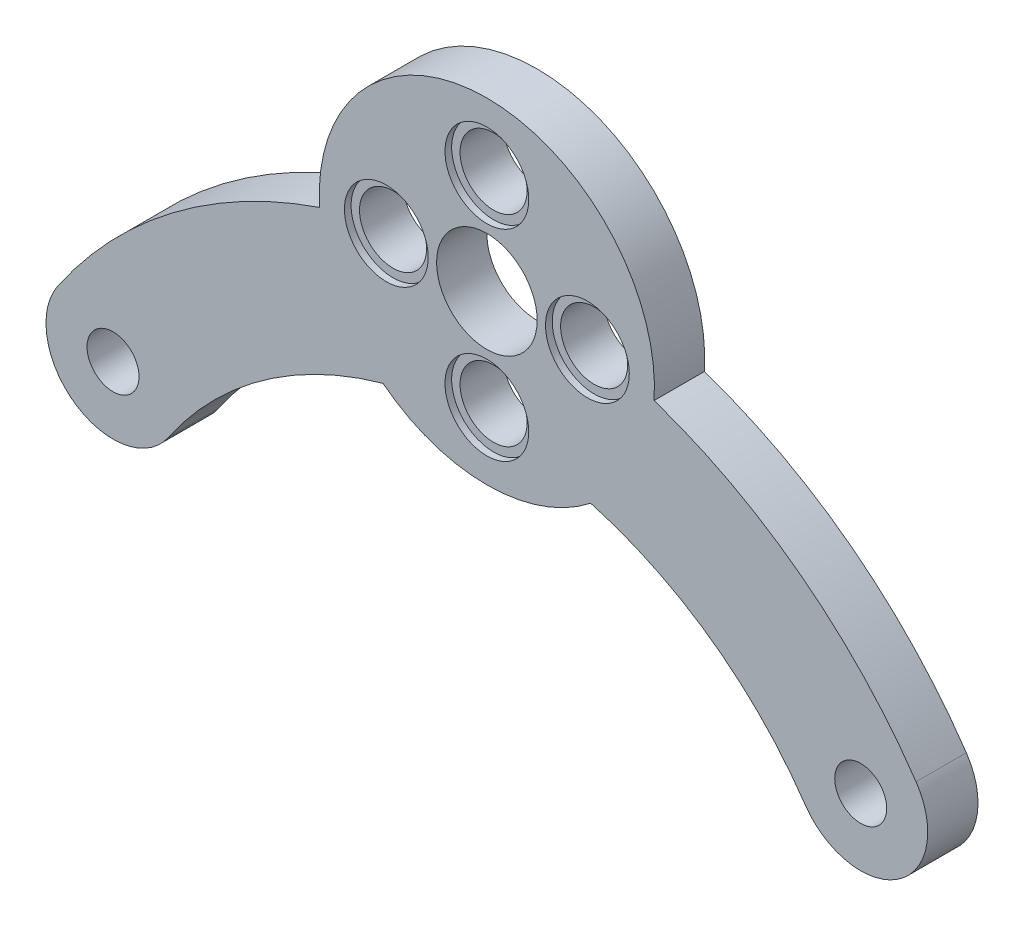
ISO-10303-21;
HEADER;
FILE_DESCRIPTION(('STEP AP214'),'2;1');
FILE_NAME('part.step','',(''),(''),'','','');
FILE_SCHEMA(('AUTOMOTIVE_DESIGN { 1 0 10303 214 1 1 1 1 }'));
ENDSEC;
DATA;
#1=APPLICATION_CONTEXT('core data for automotive mechanical design processes');
#2=APPLICATION_PROTOCOL_DEFINITION('international standard','automotive_design',2000,#1);
#3=PRODUCT_CONTEXT('',#1,'mechanical');
#4=PRODUCT('Part','Part','',(#3));
#5=PRODUCT_RELATED_PRODUCT_CATEGORY('part','',(#4));
#6=PRODUCT_DEFINITION_FORMATION('','',#4);
#7=PRODUCT_DEFINITION_CONTEXT('part definition',#1,'design');
#8=PRODUCT_DEFINITION('design','',#6,#7);
#9=PRODUCT_DEFINITION_SHAPE('','',#8);
#10=(LENGTH_UNIT() NAMED_UNIT(*) SI_UNIT(.MILLI.,.METRE.));
#11=(NAMED_UNIT(*) PLANE_ANGLE_UNIT() SI_UNIT($,.RADIAN.));
#12=(NAMED_UNIT(*) SI_UNIT($,.STERADIAN.) SOLID_ANGLE_UNIT());
#13=UNCERTAINTY_MEASURE_WITH_UNIT(LENGTH_MEASURE(1.E-05),#10,'distance_accuracy_value','');
#14=(GEOMETRIC_REPRESENTATION_CONTEXT(3) GLOBAL_UNCERTAINTY_ASSIGNED_CONTEXT((#13)) GLOBAL_UNIT_ASSIGNED_CONTEXT((#10,
#11,#12)) REPRESENTATION_CONTEXT('',''));
#15=CARTESIAN_POINT('',(0.,0.,0.));
#16=DIRECTION('',(0.,0.,1.));
#17=DIRECTION('',(1.,0.,0.));
#18=AXIS2_PLACEMENT_3D('',#15,#16,#17);
#19=CARTESIAN_POINT('',(6.,30.,0.));
#20=DIRECTION('',(0.,0.,1.));
#21=DIRECTION('',(1.,0.,0.));
#22=AXIS2_PLACEMENT_3D('',#19,#20,#21);
#23=CYLINDRICAL_SURFACE('',#22,2.);
#24=CARTESIAN_POINT('',(6.,30.,0.));
#25=DIRECTION('',(0.,0.,1.));
#26=DIRECTION('',(1.,0.,0.));
#27=AXIS2_PLACEMENT_3D('',#24,#25,#26);
#28=CIRCLE('',#27,2.);
#29=CARTESIAN_POINT('',(8.,30.,0.));
#30=VERTEX_POINT('',#29);
#31=EDGE_CURVE('E230',#30,#30,#28,.T.);
#32=ORIENTED_EDGE('',*,*,#31,.F.);
#33=EDGE_LOOP('',(#32));
#34=FACE_BOUND('',#33,.T.);
#35=CARTESIAN_POINT('',(6.,30.,2.6));
#36=DIRECTION('',(0.,0.,1.));
#37=DIRECTION('',(1.,0.,0.));
#38=AXIS2_PLACEMENT_3D('',#35,#36,#37);
#39=CIRCLE('',#38,2.);
#40=CARTESIAN_POINT('',(8.,30.,2.6));
#41=VERTEX_POINT('',#40);
#42=EDGE_CURVE('E36',#41,#41,#39,.F.);
#43=ORIENTED_EDGE('',*,*,#42,.F.);
#44=EDGE_LOOP('',(#43));
#45=FACE_BOUND('',#44,.T.);
#46=ADVANCED_FACE('F32',(#34,#45),#23,.F.);
#47=CARTESIAN_POINT('',(-6.,30.,0.));
#48=DIRECTION('',(0.,0.,1.));
#49=DIRECTION('',(1.,0.,0.));
#50=AXIS2_PLACEMENT_3D('',#47,#48,#49);
#51=CYLINDRICAL_SURFACE('',#50,2.);
#52=CARTESIAN_POINT('',(-6.,30.,0.));
#53=DIRECTION('',(0.,0.,1.));
#54=DIRECTION('',(1.,0.,0.));
#55=AXIS2_PLACEMENT_3D('',#52,#53,#54);
#56=CIRCLE('',#55,2.);
#57=CARTESIAN_POINT('',(-4.,30.,0.));
#58=VERTEX_POINT('',#57);
#59=EDGE_CURVE('E224',#58,#58,#56,.T.);
#60=ORIENTED_EDGE('',*,*,#59,.F.);
#61=EDGE_LOOP('',(#60));
#62=FACE_BOUND('',#61,.T.);
#63=CARTESIAN_POINT('',(-6.,30.,2.6));
#64=DIRECTION('',(0.,0.,1.));
#65=DIRECTION('',(1.,0.,0.));
#66=AXIS2_PLACEMENT_3D('',#63,#64,#65);
#67=CIRCLE('',#66,2.);
#68=CARTESIAN_POINT('',(-4.,30.,2.6));
#69=VERTEX_POINT('',#68);
#70=EDGE_CURVE('E195',#69,#69,#67,.F.);
#71=ORIENTED_EDGE('',*,*,#70,.F.);
#72=EDGE_LOOP('',(#71));
#73=FACE_BOUND('',#72,.T.);
#74=ADVANCED_FACE('F260',(#62,#73),#51,.F.);
#75=CARTESIAN_POINT('',(0.,36.,0.));
#76=DIRECTION('',(0.,0.,1.));
#77=DIRECTION('',(1.,0.,0.));
#78=AXIS2_PLACEMENT_3D('',#75,#76,#77);
#79=CYLINDRICAL_SURFACE('',#78,2.);
#80=CARTESIAN_POINT('',(0.,36.,0.));
#81=DIRECTION('',(0.,0.,1.));
#82=DIRECTION('',(1.,0.,0.));
#83=AXIS2_PLACEMENT_3D('',#80,#81,#82);
#84=CIRCLE('',#83,2.);
#85=CARTESIAN_POINT('',(2.,36.,0.));
#86=VERTEX_POINT('',#85);
#87=EDGE_CURVE('E223',#86,#86,#84,.T.);
#88=ORIENTED_EDGE('',*,*,#87,.F.);
#89=EDGE_LOOP('',(#88));
#90=FACE_BOUND('',#89,.T.);
#91=CARTESIAN_POINT('',(0.,36.,2.6));
#92=DIRECTION('',(0.,0.,1.));
#93=DIRECTION('',(1.,0.,0.));
#94=AXIS2_PLACEMENT_3D('',#91,#92,#93);
#95=CIRCLE('',#94,2.);
#96=CARTESIAN_POINT('',(2.,36.,2.6));
#97=VERTEX_POINT('',#96);
#98=EDGE_CURVE('E193',#97,#97,#95,.F.);
#99=ORIENTED_EDGE('',*,*,#98,.F.);
#100=EDGE_LOOP('',(#99));
#101=FACE_BOUND('',#100,.T.);
#102=ADVANCED_FACE('F266',(#90,#101),#79,.F.);
#103=CARTESIAN_POINT('',(0.,24.,0.));
#104=DIRECTION('',(0.,0.,1.));
#105=DIRECTION('',(1.,0.,0.));
#106=AXIS2_PLACEMENT_3D('',#103,#104,#105);
#107=CYLINDRICAL_SURFACE('',#106,2.);
#108=CARTESIAN_POINT('',(0.,24.,0.));
#109=DIRECTION('',(0.,0.,1.));
#110=DIRECTION('',(1.,0.,0.));
#111=AXIS2_PLACEMENT_3D('',#108,#109,#110);
#112=CIRCLE('',#111,2.);
#113=CARTESIAN_POINT('',(2.,24.,0.));
#114=VERTEX_POINT('',#113);
#115=EDGE_CURVE('E227',#114,#114,#112,.T.);
#116=ORIENTED_EDGE('',*,*,#115,.F.);
#117=EDGE_LOOP('',(#116));
#118=FACE_BOUND('',#117,.T.);
#119=CARTESIAN_POINT('',(0.,24.,2.6));
#120=DIRECTION('',(0.,0.,1.));
#121=DIRECTION('',(1.,0.,0.));
#122=AXIS2_PLACEMENT_3D('',#119,#120,#121);
#123=CIRCLE('',#122,2.);
#124=CARTESIAN_POINT('',(2.,24.,2.6));
#125=VERTEX_POINT('',#124);
#126=EDGE_CURVE('E188',#125,#125,#123,.F.);
#127=ORIENTED_EDGE('',*,*,#126,.F.);
#128=EDGE_LOOP('',(#127));
#129=FACE_BOUND('',#128,.T.);
#130=ADVANCED_FACE('F272',(#118,#129),#107,.F.);
#131=CARTESIAN_POINT('',(0.,0.,3.));
#132=DIRECTION('',(0.,0.,-1.));
#133=DIRECTION('',(-1.,0.,0.));
#134=AXIS2_PLACEMENT_3D('',#131,#132,#133);
#135=CYLINDRICAL_SURFACE('',#134,23.);
#136=CARTESIAN_POINT('',(0.,0.,0.));
#137=DIRECTION('',(0.,0.,-1.));
#138=DIRECTION('',(-1.,0.,0.));
#139=AXIS2_PLACEMENT_3D('',#136,#137,#138);
#140=CIRCLE('',#139,23.);
#141=CARTESIAN_POINT('',(6.19495762697375,22.15,0.));
#142=VERTEX_POINT('',#141);
#143=CARTESIAN_POINT('',(19.0022770149448,12.9581429320447,0.));
#144=VERTEX_POINT('',#143);
#145=EDGE_CURVE('E120',#142,#144,#140,.T.);
#146=ORIENTED_EDGE('',*,*,#145,.T.);
#147=DIRECTION('',(0.,0.,-1.));
#148=VECTOR('',#147,1.);
#149=CARTESIAN_POINT('',(19.0022770149448,12.9581429320447,3.));
#150=LINE('',#149,#148);
#151=CARTESIAN_POINT('',(19.0022770149448,12.9581429320447,3.));
#152=VERTEX_POINT('',#151);
#153=EDGE_CURVE('E41',#144,#152,#150,.F.);
#154=ORIENTED_EDGE('',*,*,#153,.T.);
#155=CARTESIAN_POINT('',(0.,0.,3.));
#156=DIRECTION('',(0.,0.,-1.));
#157=DIRECTION('',(-1.,0.,0.));
#158=AXIS2_PLACEMENT_3D('',#155,#156,#157);
#159=CIRCLE('',#158,23.);
#160=CARTESIAN_POINT('',(6.19495762697375,22.15,3.));
#161=VERTEX_POINT('',#160);
#162=EDGE_CURVE('E148',#161,#152,#159,.T.);
#163=ORIENTED_EDGE('',*,*,#162,.F.);
#164=DIRECTION('',(0.,0.,1.));
#165=VECTOR('',#164,1.);
#166=CARTESIAN_POINT('',(6.19495762697375,22.15,1.5));
#167=LINE('',#166,#165);
#168=EDGE_CURVE('E129',#161,#142,#167,.F.);
#169=ORIENTED_EDGE('',*,*,#168,.T.);
#170=EDGE_LOOP('',(#146,#154,#163,#169));
#171=FACE_BOUND('',#170,.T.);
#172=ADVANCED_FACE('F274',(#171),#135,.F.);
#173=CARTESIAN_POINT('',(0.,0.,3.));
#174=DIRECTION('',(0.,0.,-1.));
#175=DIRECTION('',(-1.,0.,0.));
#176=AXIS2_PLACEMENT_3D('',#173,#174,#175);
#177=CYLINDRICAL_SURFACE('',#176,31.);
#178=CARTESIAN_POINT('',(0.,0.,3.));
#179=DIRECTION('',(0.,0.,1.));
#180=DIRECTION('',(-1.,0.,0.));
#181=AXIS2_PLACEMENT_3D('',#178,#179,#180);
#182=CIRCLE('',#181,31.);
#183=CARTESIAN_POINT('',(25.611764672317,17.4653230823211,3.));
#184=VERTEX_POINT('',#183);
#185=CARTESIAN_POINT('',(9.97885263945711,29.35,3.));
#186=VERTEX_POINT('',#185);
#187=EDGE_CURVE('E119',#184,#186,#182,.T.);
#188=ORIENTED_EDGE('',*,*,#187,.F.);
#189=DIRECTION('',(0.,0.,-1.));
#190=VECTOR('',#189,1.);
#191=CARTESIAN_POINT('',(25.611764672317,17.4653230823211,3.));
#192=LINE('',#191,#190);
#193=CARTESIAN_POINT('',(25.611764672317,17.4653230823211,0.));
#194=VERTEX_POINT('',#193);
#195=EDGE_CURVE('E11',#184,#194,#192,.T.);
#196=ORIENTED_EDGE('',*,*,#195,.T.);
#197=CARTESIAN_POINT('',(0.,0.,0.));
#198=DIRECTION('',(0.,0.,1.));
#199=DIRECTION('',(-1.,0.,0.));
#200=AXIS2_PLACEMENT_3D('',#197,#198,#199);
#201=CIRCLE('',#200,31.);
#202=CARTESIAN_POINT('',(9.97885263945711,29.35,0.));
#203=VERTEX_POINT('',#202);
#204=EDGE_CURVE('E142',#194,#203,#201,.T.);
#205=ORIENTED_EDGE('',*,*,#204,.T.);
#206=DIRECTION('',(0.,0.,-1.));
#207=VECTOR('',#206,1.);
#208=CARTESIAN_POINT('',(9.97885263945711,29.35,3.));
#209=LINE('',#208,#207);
#210=EDGE_CURVE('E160',#186,#203,#209,.T.);
#211=ORIENTED_EDGE('',*,*,#210,.F.);
#212=EDGE_LOOP('',(#188,#196,#205,#211));
#213=FACE_BOUND('',#212,.T.);
#214=ADVANCED_FACE('F280',(#213),#177,.T.);
#215=CARTESIAN_POINT('',(0.,30.,3.));
#216=DIRECTION('',(0.,0.,-1.));
#217=DIRECTION('',(-1.,0.,0.));
#218=AXIS2_PLACEMENT_3D('',#215,#216,#217);
#219=CYLINDRICAL_SURFACE('',#218,10.);
#220=CARTESIAN_POINT('',(0.,30.,0.));
#221=DIRECTION('',(0.,0.,1.));
#222=DIRECTION('',(1.,0.,0.));
#223=AXIS2_PLACEMENT_3D('',#220,#221,#222);
#224=CIRCLE('',#223,10.);
#225=CARTESIAN_POINT('',(-9.97885263945711,29.35,0.));
#226=VERTEX_POINT('',#225);
#227=EDGE_CURVE('E153',#203,#226,#224,.T.);
#228=ORIENTED_EDGE('',*,*,#227,.T.);
#229=DIRECTION('',(0.,0.,-1.));
#230=VECTOR('',#229,1.);
#231=CARTESIAN_POINT('',(-9.97885263945711,29.35,3.));
#232=LINE('',#231,#230);
#233=CARTESIAN_POINT('',(-9.97885263945711,29.35,3.));
#234=VERTEX_POINT('',#233);
#235=EDGE_CURVE('E151',#234,#226,#232,.T.);
#236=ORIENTED_EDGE('',*,*,#235,.F.);
#237=CARTESIAN_POINT('',(0.,30.,3.));
#238=DIRECTION('',(0.,0.,1.));
#239=DIRECTION('',(1.,0.,0.));
#240=AXIS2_PLACEMENT_3D('',#237,#238,#239);
#241=CIRCLE('',#240,10.);
#242=EDGE_CURVE('E144',#186,#234,#241,.T.);
#243=ORIENTED_EDGE('',*,*,#242,.F.);
#244=ORIENTED_EDGE('',*,*,#210,.T.);
#245=EDGE_LOOP('',(#228,#236,#243,#244));
#246=FACE_BOUND('',#245,.T.);
#247=ADVANCED_FACE('F369',(#246),#219,.T.);
#248=CARTESIAN_POINT('',(0.,0.,3.));
#249=DIRECTION('',(0.,0.,-1.));
#250=DIRECTION('',(-1.,0.,0.));
#251=AXIS2_PLACEMENT_3D('',#248,#249,#250);
#252=CYLINDRICAL_SURFACE('',#251,31.);
#253=CARTESIAN_POINT('',(0.,0.,0.));
#254=DIRECTION('',(0.,0.,1.));
#255=DIRECTION('',(1.,0.,0.));
#256=AXIS2_PLACEMENT_3D('',#253,#254,#255);
#257=CIRCLE('',#256,31.);
#258=CARTESIAN_POINT('',(-25.611764672317,17.4653230823211,0.));
#259=VERTEX_POINT('',#258);
#260=EDGE_CURVE('E155',#226,#259,#257,.T.);
#261=ORIENTED_EDGE('',*,*,#260,.T.);
#262=DIRECTION('',(0.,0.,-1.));
#263=VECTOR('',#262,1.);
#264=CARTESIAN_POINT('',(-25.611764672317,17.4653230823211,3.));
#265=LINE('',#264,#263);
#266=CARTESIAN_POINT('',(-25.611764672317,17.4653230823211,3.));
#267=VERTEX_POINT('',#266);
#268=EDGE_CURVE('E171',#259,#267,#265,.F.);
#269=ORIENTED_EDGE('',*,*,#268,.T.);
#270=CARTESIAN_POINT('',(0.,0.,3.));
#271=DIRECTION('',(0.,0.,1.));
#272=DIRECTION('',(1.,0.,0.));
#273=AXIS2_PLACEMENT_3D('',#270,#271,#272);
#274=CIRCLE('',#273,31.);
#275=EDGE_CURVE('E146',#234,#267,#274,.T.);
#276=ORIENTED_EDGE('',*,*,#275,.F.);
#277=ORIENTED_EDGE('',*,*,#235,.T.);
#278=EDGE_LOOP('',(#261,#269,#276,#277));
#279=FACE_BOUND('',#278,.T.);
#280=ADVANCED_FACE('F363',(#279),#252,.T.);
#281=CARTESIAN_POINT('',(-19.0022770149448,12.9581429320447,3.));
#282=VERTEX_POINT('',#281);
#283=CARTESIAN_POINT('',(-6.19495762697375,22.15,3.));
#284=VERTEX_POINT('',#283);
#285=EDGE_CURVE('E149',#282,#284,#159,.T.);
#286=ORIENTED_EDGE('',*,*,#285,.F.);
#287=DIRECTION('',(0.,0.,-1.));
#288=VECTOR('',#287,1.);
#289=CARTESIAN_POINT('',(-19.0022770149448,12.9581429320447,3.));
#290=LINE('',#289,#288);
#291=CARTESIAN_POINT('',(-19.0022770149448,12.9581429320447,0.));
#292=VERTEX_POINT('',#291);
#293=EDGE_CURVE('E115',#282,#292,#290,.T.);
#294=ORIENTED_EDGE('',*,*,#293,.T.);
#295=CARTESIAN_POINT('',(-6.19495762697375,22.15,0.));
#296=VERTEX_POINT('',#295);
#297=EDGE_CURVE('E109',#292,#296,#140,.T.);
#298=ORIENTED_EDGE('',*,*,#297,.T.);
#299=DIRECTION('',(0.,0.,1.));
#300=VECTOR('',#299,1.);
#301=CARTESIAN_POINT('',(-6.19495762697375,22.15,1.5));
#302=LINE('',#301,#300);
#303=EDGE_CURVE('E113',#296,#284,#302,.T.);
#304=ORIENTED_EDGE('',*,*,#303,.T.);
#305=EDGE_LOOP('',(#286,#294,#298,#304));
#306=FACE_BOUND('',#305,.T.);
#307=ADVANCED_FACE('F112',(#306),#135,.F.);
#308=CARTESIAN_POINT('',(0.,0.,3.));
#309=DIRECTION('',(0.,0.,-1.));
#310=DIRECTION('',(-1.,0.,0.));
#311=AXIS2_PLACEMENT_3D('',#308,#309,#310);
#312=PLANE('',#311);
#313=CARTESIAN_POINT('',(6.,30.,3.));
#314=DIRECTION('',(0.,0.,1.));
#315=DIRECTION('',(1.,0.,0.));
#316=AXIS2_PLACEMENT_3D('',#313,#314,#315);
#317=CIRCLE('',#316,2.5);
#318=CARTESIAN_POINT('',(8.5,30.,3.));
#319=VERTEX_POINT('',#318);
#320=EDGE_CURVE('E329',#319,#319,#317,.T.);
#321=ORIENTED_EDGE('',*,*,#320,.F.);
#322=EDGE_LOOP('',(#321));
#323=FACE_BOUND('',#322,.T.);
#324=CARTESIAN_POINT('',(0.,36.,3.));
#325=DIRECTION('',(0.,0.,1.));
#326=DIRECTION('',(1.,0.,0.));
#327=AXIS2_PLACEMENT_3D('',#324,#325,#326);
#328=CIRCLE('',#327,2.5);
#329=CARTESIAN_POINT('',(2.5,36.,3.));
#330=VERTEX_POINT('',#329);
#331=EDGE_CURVE('E337',#330,#330,#328,.T.);
#332=ORIENTED_EDGE('',*,*,#331,.F.);
#333=EDGE_LOOP('',(#332));
#334=FACE_BOUND('',#333,.T.);
#335=CARTESIAN_POINT('',(-6.,30.,3.));
#336=DIRECTION('',(0.,0.,1.));
#337=DIRECTION('',(1.,0.,0.));
#338=AXIS2_PLACEMENT_3D('',#335,#336,#337);
#339=CIRCLE('',#338,2.5);
#340=CARTESIAN_POINT('',(-3.5,30.,3.));
#341=VERTEX_POINT('',#340);
#342=EDGE_CURVE('E342',#341,#341,#339,.T.);
#343=ORIENTED_EDGE('',*,*,#342,.F.);
#344=EDGE_LOOP('',(#343));
#345=FACE_BOUND('',#344,.T.);
#346=CARTESIAN_POINT('',(0.,24.,3.));
#347=DIRECTION('',(0.,0.,1.));
#348=DIRECTION('',(1.,0.,0.));
#349=AXIS2_PLACEMENT_3D('',#346,#347,#348);
#350=CIRCLE('',#349,2.5);
#351=CARTESIAN_POINT('',(2.5,24.,3.));
#352=VERTEX_POINT('',#351);
#353=EDGE_CURVE('E201',#352,#352,#350,.T.);
#354=ORIENTED_EDGE('',*,*,#353,.F.);
#355=EDGE_LOOP('',(#354));
#356=FACE_BOUND('',#355,.T.);
#357=CARTESIAN_POINT('',(-22.3070208436309,15.2117330071829,3.));
#358=DIRECTION('',(0.,0.,-1.));
#359=DIRECTION('',(-1.,0.,0.));
#360=AXIS2_PLACEMENT_3D('',#357,#358,#359);
#361=CIRCLE('',#360,1.55);
#362=CARTESIAN_POINT('',(-23.8570208436309,15.2117330071829,3.));
#363=VERTEX_POINT('',#362);
#364=EDGE_CURVE('E214',#363,#363,#361,.T.);
#365=ORIENTED_EDGE('',*,*,#364,.T.);
#366=EDGE_LOOP('',(#365));
#367=FACE_BOUND('',#366,.T.);
#368=CARTESIAN_POINT('',(22.3070208436309,15.2117330071829,3.));
#369=DIRECTION('',(0.,0.,-1.));
#370=DIRECTION('',(-1.,0.,0.));
#371=AXIS2_PLACEMENT_3D('',#368,#369,#370);
#372=CIRCLE('',#371,1.55);
#373=CARTESIAN_POINT('',(20.7570208436309,15.2117330071829,3.));
#374=VERTEX_POINT('',#373);
#375=EDGE_CURVE('E220',#374,#374,#372,.T.);
#376=ORIENTED_EDGE('',*,*,#375,.T.);
#377=EDGE_LOOP('',(#376));
#378=FACE_BOUND('',#377,.T.);
#379=CARTESIAN_POINT('',(0.,30.,3.));
#380=DIRECTION('',(0.,0.,-1.));
#381=DIRECTION('',(-1.,0.,0.));
#382=AXIS2_PLACEMENT_3D('',#379,#380,#381);
#383=CIRCLE('',#382,3.);
#384=CARTESIAN_POINT('',(-3.,30.,3.));
#385=VERTEX_POINT('',#384);
#386=EDGE_CURVE('E138',#385,#385,#383,.T.);
#387=ORIENTED_EDGE('',*,*,#386,.T.);
#388=EDGE_LOOP('',(#387));
#389=FACE_BOUND('',#388,.T.);
#390=ORIENTED_EDGE('',*,*,#275,.T.);
#391=CARTESIAN_POINT('',(-22.3070208436309,15.2117330071829,3.));
#392=DIRECTION('',(0.,0.,-1.));
#393=DIRECTION('',(-1.,0.,0.));
#394=AXIS2_PLACEMENT_3D('',#391,#392,#393);
#395=CIRCLE('',#394,4.);
#396=CARTESIAN_POINT('',(-24.0461512784135,11.6095912372336,3.));
#397=VERTEX_POINT('',#396);
#398=EDGE_CURVE('E49',#267,#397,#395,.F.);
#399=ORIENTED_EDGE('',*,*,#398,.T.);
#400=CARTESIAN_POINT('',(-22.3070208436309,15.2117330071829,3.));
#401=DIRECTION('',(0.,0.,-1.));
#402=DIRECTION('',(-1.,0.,0.));
#403=AXIS2_PLACEMENT_3D('',#400,#401,#402);
#404=CIRCLE('',#403,4.);
#405=EDGE_CURVE('E177',#397,#282,#404,.F.);
#406=ORIENTED_EDGE('',*,*,#405,.T.);
#407=ORIENTED_EDGE('',*,*,#285,.T.);
#408=CARTESIAN_POINT('',(0.,30.,3.));
#409=DIRECTION('',(0.,0.,1.));
#410=DIRECTION('',(1.,0.,0.));
#411=AXIS2_PLACEMENT_3D('',#408,#409,#410);
#412=CIRCLE('',#411,10.);
#413=EDGE_CURVE('E128',#284,#161,#412,.T.);
#414=ORIENTED_EDGE('',*,*,#413,.T.);
#415=ORIENTED_EDGE('',*,*,#162,.T.);
#416=CARTESIAN_POINT('',(22.3070208436309,15.2117330071829,3.));
#417=DIRECTION('',(0.,0.,-1.));
#418=DIRECTION('',(-1.,0.,0.));
#419=AXIS2_PLACEMENT_3D('',#416,#417,#418);
#420=CIRCLE('',#419,4.);
#421=CARTESIAN_POINT('',(24.0461512784135,11.6095912372336,3.));
#422=VERTEX_POINT('',#421);
#423=EDGE_CURVE('E175',#152,#422,#420,.F.);
#424=ORIENTED_EDGE('',*,*,#423,.T.);
#425=CARTESIAN_POINT('',(22.3070208436309,15.2117330071829,3.));
#426=DIRECTION('',(0.,0.,-1.));
#427=DIRECTION('',(-1.,0.,0.));
#428=AXIS2_PLACEMENT_3D('',#425,#426,#427);
#429=CIRCLE('',#428,4.);
#430=EDGE_CURVE('E56',#422,#184,#429,.F.);
#431=ORIENTED_EDGE('',*,*,#430,.T.);
#432=ORIENTED_EDGE('',*,*,#187,.T.);
#433=ORIENTED_EDGE('',*,*,#242,.T.);
#434=EDGE_LOOP('',(#390,#399,#406,#407,#414,#415,#424,#431,#432,#433));
#435=FACE_BOUND('',#434,.T.);
#436=ADVANCED_FACE('F241',(#323,#334,#345,#356,#367,#378,#389,#435),#312,.F.);
#437=CARTESIAN_POINT('',(0.,0.,0.));
#438=DIRECTION('',(0.,0.,-1.));
#439=DIRECTION('',(-1.,0.,0.));
#440=AXIS2_PLACEMENT_3D('',#437,#438,#439);
#441=PLANE('',#440);
#442=CARTESIAN_POINT('',(-22.3070208436309,15.2117330071829,0.));
#443=DIRECTION('',(0.,0.,1.));
#444=DIRECTION('',(1.,0.,0.));
#445=AXIS2_PLACEMENT_3D('',#442,#443,#444);
#446=CIRCLE('',#445,1.55);
#447=CARTESIAN_POINT('',(-20.7570208436309,15.2117330071829,0.));
#448=VERTEX_POINT('',#447);
#449=EDGE_CURVE('E191',#448,#448,#446,.T.);
#450=ORIENTED_EDGE('',*,*,#449,.T.);
#451=EDGE_LOOP('',(#450));
#452=FACE_BOUND('',#451,.T.);
#453=CARTESIAN_POINT('',(22.3070208436309,15.2117330071829,0.));
#454=DIRECTION('',(0.,0.,1.));
#455=DIRECTION('',(1.,0.,0.));
#456=AXIS2_PLACEMENT_3D('',#453,#454,#455);
#457=CIRCLE('',#456,1.55);
#458=CARTESIAN_POINT('',(23.8570208436309,15.2117330071829,0.));
#459=VERTEX_POINT('',#458);
#460=EDGE_CURVE('E217',#459,#459,#457,.T.);
#461=ORIENTED_EDGE('',*,*,#460,.T.);
#462=EDGE_LOOP('',(#461));
#463=FACE_BOUND('',#462,.T.);
#464=ORIENTED_EDGE('',*,*,#87,.T.);
#465=EDGE_LOOP('',(#464));
#466=FACE_BOUND('',#465,.T.);
#467=ORIENTED_EDGE('',*,*,#59,.T.);
#468=EDGE_LOOP('',(#467));
#469=FACE_BOUND('',#468,.T.);
#470=ORIENTED_EDGE('',*,*,#115,.T.);
#471=EDGE_LOOP('',(#470));
#472=FACE_BOUND('',#471,.T.);
#473=ORIENTED_EDGE('',*,*,#31,.T.);
#474=EDGE_LOOP('',(#473));
#475=FACE_BOUND('',#474,.T.);
#476=CARTESIAN_POINT('',(0.,30.,0.));
#477=DIRECTION('',(0.,0.,1.));
#478=DIRECTION('',(1.,0.,0.));
#479=AXIS2_PLACEMENT_3D('',#476,#477,#478);
#480=CIRCLE('',#479,3.);
#481=CARTESIAN_POINT('',(3.,30.,0.));
#482=VERTEX_POINT('',#481);
#483=EDGE_CURVE('E233',#482,#482,#480,.T.);
#484=ORIENTED_EDGE('',*,*,#483,.T.);
#485=EDGE_LOOP('',(#484));
#486=FACE_BOUND('',#485,.T.);
#487=CARTESIAN_POINT('',(-22.3070208436309,15.2117330071829,0.));
#488=DIRECTION('',(0.,0.,-1.));
#489=DIRECTION('',(-1.,0.,0.));
#490=AXIS2_PLACEMENT_3D('',#487,#488,#489);
#491=CIRCLE('',#490,4.);
#492=CARTESIAN_POINT('',(-24.0461512784135,11.6095912372336,0.));
#493=VERTEX_POINT('',#492);
#494=EDGE_CURVE('E167',#292,#493,#491,.T.);
#495=ORIENTED_EDGE('',*,*,#494,.T.);
#496=CARTESIAN_POINT('',(-22.3070208436309,15.2117330071829,0.));
#497=DIRECTION('',(0.,0.,-1.));
#498=DIRECTION('',(-1.,0.,0.));
#499=AXIS2_PLACEMENT_3D('',#496,#497,#498);
#500=CIRCLE('',#499,4.);
#501=EDGE_CURVE('E169',#493,#259,#500,.T.);
#502=ORIENTED_EDGE('',*,*,#501,.T.);
#503=ORIENTED_EDGE('',*,*,#260,.F.);
#504=ORIENTED_EDGE('',*,*,#227,.F.);
#505=ORIENTED_EDGE('',*,*,#204,.F.);
#506=CARTESIAN_POINT('',(22.3070208436309,15.2117330071829,0.));
#507=DIRECTION('',(0.,0.,-1.));
#508=DIRECTION('',(-1.,0.,0.));
#509=AXIS2_PLACEMENT_3D('',#506,#507,#508);
#510=CIRCLE('',#509,4.);
#511=CARTESIAN_POINT('',(24.0461512784135,11.6095912372336,0.));
#512=VERTEX_POINT('',#511);
#513=EDGE_CURVE('E163',#194,#512,#510,.T.);
#514=ORIENTED_EDGE('',*,*,#513,.T.);
#515=CARTESIAN_POINT('',(22.3070208436309,15.2117330071829,0.));
#516=DIRECTION('',(0.,0.,-1.));
#517=DIRECTION('',(-1.,0.,0.));
#518=AXIS2_PLACEMENT_3D('',#515,#516,#517);
#519=CIRCLE('',#518,4.);
#520=EDGE_CURVE('E165',#512,#144,#519,.T.);
#521=ORIENTED_EDGE('',*,*,#520,.T.);
#522=ORIENTED_EDGE('',*,*,#145,.F.);
#523=CARTESIAN_POINT('',(0.,30.,0.));
#524=DIRECTION('',(0.,0.,1.));
#525=DIRECTION('',(1.,0.,0.));
#526=AXIS2_PLACEMENT_3D('',#523,#524,#525);
#527=CIRCLE('',#526,10.);
#528=EDGE_CURVE('E126',#296,#142,#527,.T.);
#529=ORIENTED_EDGE('',*,*,#528,.F.);
#530=ORIENTED_EDGE('',*,*,#297,.F.);
#531=EDGE_LOOP('',(#495,#502,#503,#504,#505,#514,#521,#522,#529,#530));
#532=FACE_BOUND('',#531,.T.);
#533=ADVANCED_FACE('F132',(#452,#463,#466,#469,#472,#475,#486,#532),#441,.T.);
#534=CARTESIAN_POINT('',(0.,30.,0.));
#535=DIRECTION('',(0.,0.,1.));
#536=DIRECTION('',(1.,0.,0.));
#537=AXIS2_PLACEMENT_3D('',#534,#535,#536);
#538=CYLINDRICAL_SURFACE('',#537,10.);
#539=ORIENTED_EDGE('',*,*,#168,.F.);
#540=ORIENTED_EDGE('',*,*,#413,.F.);
#541=ORIENTED_EDGE('',*,*,#303,.F.);
#542=ORIENTED_EDGE('',*,*,#528,.T.);
#543=EDGE_LOOP('',(#539,#540,#541,#542));
#544=FACE_BOUND('',#543,.T.);
#545=ADVANCED_FACE('F125',(#544),#538,.T.);
#546=CARTESIAN_POINT('',(-22.3070208436309,15.2117330071829,3.));
#547=DIRECTION('',(0.,0.,-1.));
#548=DIRECTION('',(-1.,0.,0.));
#549=AXIS2_PLACEMENT_3D('',#546,#547,#548);
#550=CYLINDRICAL_SURFACE('',#549,4.);
#551=ORIENTED_EDGE('',*,*,#293,.F.);
#552=ORIENTED_EDGE('',*,*,#405,.F.);
#553=DIRECTION('',(0.,0.,-1.));
#554=VECTOR('',#553,1.);
#555=CARTESIAN_POINT('',(-24.0461512784135,11.6095912372336,3.));
#556=LINE('',#555,#554);
#557=EDGE_CURVE('E135',#493,#397,#556,.F.);
#558=ORIENTED_EDGE('',*,*,#557,.F.);
#559=ORIENTED_EDGE('',*,*,#494,.F.);
#560=EDGE_LOOP('',(#551,#552,#558,#559));
#561=FACE_BOUND('',#560,.T.);
#562=ADVANCED_FACE('F380',(#561),#550,.T.);
#563=CARTESIAN_POINT('',(-22.3070208436309,15.2117330071829,3.));
#564=DIRECTION('',(0.,0.,-1.));
#565=DIRECTION('',(-1.,0.,0.));
#566=AXIS2_PLACEMENT_3D('',#563,#564,#565);
#567=CYLINDRICAL_SURFACE('',#566,4.);
#568=ORIENTED_EDGE('',*,*,#398,.F.);
#569=ORIENTED_EDGE('',*,*,#268,.F.);
#570=ORIENTED_EDGE('',*,*,#501,.F.);
#571=ORIENTED_EDGE('',*,*,#557,.T.);
#572=EDGE_LOOP('',(#568,#569,#570,#571));
#573=FACE_BOUND('',#572,.T.);
#574=ADVANCED_FACE('F377',(#573),#567,.T.);
#575=CARTESIAN_POINT('',(22.3070208436309,15.2117330071829,3.));
#576=DIRECTION('',(0.,0.,-1.));
#577=DIRECTION('',(-1.,0.,0.));
#578=AXIS2_PLACEMENT_3D('',#575,#576,#577);
#579=CYLINDRICAL_SURFACE('',#578,4.);
#580=ORIENTED_EDGE('',*,*,#195,.F.);
#581=ORIENTED_EDGE('',*,*,#430,.F.);
#582=DIRECTION('',(0.,0.,-1.));
#583=VECTOR('',#582,1.);
#584=CARTESIAN_POINT('',(24.0461512784135,11.6095912372336,3.));
#585=LINE('',#584,#583);
#586=EDGE_CURVE('E185',#512,#422,#585,.F.);
#587=ORIENTED_EDGE('',*,*,#586,.F.);
#588=ORIENTED_EDGE('',*,*,#513,.F.);
#589=EDGE_LOOP('',(#580,#581,#587,#588));
#590=FACE_BOUND('',#589,.T.);
#591=ADVANCED_FACE('F34',(#590),#579,.T.);
#592=CARTESIAN_POINT('',(22.3070208436309,15.2117330071829,3.));
#593=DIRECTION('',(0.,0.,-1.));
#594=DIRECTION('',(-1.,0.,0.));
#595=AXIS2_PLACEMENT_3D('',#592,#593,#594);
#596=CYLINDRICAL_SURFACE('',#595,4.);
#597=ORIENTED_EDGE('',*,*,#423,.F.);
#598=ORIENTED_EDGE('',*,*,#153,.F.);
#599=ORIENTED_EDGE('',*,*,#520,.F.);
#600=ORIENTED_EDGE('',*,*,#586,.T.);
#601=EDGE_LOOP('',(#597,#598,#599,#600));
#602=FACE_BOUND('',#601,.T.);
#603=ADVANCED_FACE('F246',(#602),#596,.T.);
#604=CARTESIAN_POINT('',(0.,30.,0.));
#605=DIRECTION('',(0.,0.,1.));
#606=DIRECTION('',(1.,0.,0.));
#607=AXIS2_PLACEMENT_3D('',#604,#605,#606);
#608=CYLINDRICAL_SURFACE('',#607,3.);
#609=ORIENTED_EDGE('',*,*,#483,.F.);
#610=EDGE_LOOP('',(#609));
#611=FACE_BOUND('',#610,.T.);
#612=ORIENTED_EDGE('',*,*,#386,.F.);
#613=EDGE_LOOP('',(#612));
#614=FACE_BOUND('',#613,.T.);
#615=ADVANCED_FACE('F243',(#611,#614),#608,.F.);
#616=CARTESIAN_POINT('',(22.3070208436309,15.2117330071829,0.));
#617=DIRECTION('',(0.,0.,1.));
#618=DIRECTION('',(1.,0.,0.));
#619=AXIS2_PLACEMENT_3D('',#616,#617,#618);
#620=CYLINDRICAL_SURFACE('',#619,1.55);
#621=ORIENTED_EDGE('',*,*,#460,.F.);
#622=EDGE_LOOP('',(#621));
#623=FACE_BOUND('',#622,.T.);
#624=ORIENTED_EDGE('',*,*,#375,.F.);
#625=EDGE_LOOP('',(#624));
#626=FACE_BOUND('',#625,.T.);
#627=ADVANCED_FACE('F245',(#623,#626),#620,.F.);
#628=CARTESIAN_POINT('',(-22.3070208436309,15.2117330071829,0.));
#629=DIRECTION('',(0.,0.,1.));
#630=DIRECTION('',(1.,0.,0.));
#631=AXIS2_PLACEMENT_3D('',#628,#629,#630);
#632=CYLINDRICAL_SURFACE('',#631,1.55);
#633=ORIENTED_EDGE('',*,*,#449,.F.);
#634=EDGE_LOOP('',(#633));
#635=FACE_BOUND('',#634,.T.);
#636=ORIENTED_EDGE('',*,*,#364,.F.);
#637=EDGE_LOOP('',(#636));
#638=FACE_BOUND('',#637,.T.);
#639=ADVANCED_FACE('F253',(#635,#638),#632,.F.);
#640=CARTESIAN_POINT('',(0.,24.,2.6));
#641=DIRECTION('',(0.,0.,1.));
#642=DIRECTION('',(1.,0.,0.));
#643=AXIS2_PLACEMENT_3D('',#640,#641,#642);
#644=PLANE('',#643);
#645=CARTESIAN_POINT('',(0.,24.,2.6));
#646=DIRECTION('',(0.,0.,1.));
#647=DIRECTION('',(1.,0.,0.));
#648=AXIS2_PLACEMENT_3D('',#645,#646,#647);
#649=CIRCLE('',#648,2.5);
#650=CARTESIAN_POINT('',(2.5,24.,2.6));
#651=VERTEX_POINT('',#650);
#652=EDGE_CURVE('E192',#651,#651,#649,.T.);
#653=ORIENTED_EDGE('',*,*,#652,.T.);
#654=EDGE_LOOP('',(#653));
#655=FACE_BOUND('',#654,.T.);
#656=ORIENTED_EDGE('',*,*,#126,.T.);
#657=EDGE_LOOP('',(#656));
#658=FACE_BOUND('',#657,.T.);
#659=ADVANCED_FACE('F288',(#655,#658),#644,.T.);
#660=CARTESIAN_POINT('',(0.,24.,2.6));
#661=DIRECTION('',(0.,0.,1.));
#662=DIRECTION('',(1.,0.,0.));
#663=AXIS2_PLACEMENT_3D('',#660,#661,#662);
#664=CYLINDRICAL_SURFACE('',#663,2.5);
#665=ORIENTED_EDGE('',*,*,#652,.F.);
#666=EDGE_LOOP('',(#665));
#667=FACE_BOUND('',#666,.T.);
#668=ORIENTED_EDGE('',*,*,#353,.T.);
#669=EDGE_LOOP('',(#668));
#670=FACE_BOUND('',#669,.T.);
#671=ADVANCED_FACE('F290',(#667,#670),#664,.F.);
#672=CARTESIAN_POINT('',(0.,36.,2.6));
#673=DIRECTION('',(0.,0.,1.));
#674=DIRECTION('',(1.,0.,0.));
#675=AXIS2_PLACEMENT_3D('',#672,#673,#674);
#676=PLANE('',#675);
#677=CARTESIAN_POINT('',(0.,36.,2.6));
#678=DIRECTION('',(0.,0.,1.));
#679=DIRECTION('',(1.,0.,0.));
#680=AXIS2_PLACEMENT_3D('',#677,#678,#679);
#681=CIRCLE('',#680,2.5);
#682=CARTESIAN_POINT('',(2.5,36.,2.6));
#683=VERTEX_POINT('',#682);
#684=EDGE_CURVE('E332',#683,#683,#681,.T.);
#685=ORIENTED_EDGE('',*,*,#684,.T.);
#686=EDGE_LOOP('',(#685));
#687=FACE_BOUND('',#686,.T.);
#688=ORIENTED_EDGE('',*,*,#98,.T.);
#689=EDGE_LOOP('',(#688));
#690=FACE_BOUND('',#689,.T.);
#691=ADVANCED_FACE('F297',(#687,#690),#676,.T.);
#692=CARTESIAN_POINT('',(0.,36.,2.6));
#693=DIRECTION('',(0.,0.,1.));
#694=DIRECTION('',(1.,0.,0.));
#695=AXIS2_PLACEMENT_3D('',#692,#693,#694);
#696=CYLINDRICAL_SURFACE('',#695,2.5);
#697=ORIENTED_EDGE('',*,*,#684,.F.);
#698=EDGE_LOOP('',(#697));
#699=FACE_BOUND('',#698,.T.);
#700=ORIENTED_EDGE('',*,*,#331,.T.);
#701=EDGE_LOOP('',(#700));
#702=FACE_BOUND('',#701,.T.);
#703=ADVANCED_FACE('F311',(#699,#702),#696,.F.);
#704=CARTESIAN_POINT('',(-6.,30.,2.6));
#705=DIRECTION('',(0.,0.,1.));
#706=DIRECTION('',(1.,0.,0.));
#707=AXIS2_PLACEMENT_3D('',#704,#705,#706);
#708=PLANE('',#707);
#709=CARTESIAN_POINT('',(-6.,30.,2.6));
#710=DIRECTION('',(0.,0.,1.));
#711=DIRECTION('',(1.,0.,0.));
#712=AXIS2_PLACEMENT_3D('',#709,#710,#711);
#713=CIRCLE('',#712,2.5);
#714=CARTESIAN_POINT('',(-3.5,30.,2.6));
#715=VERTEX_POINT('',#714);
#716=EDGE_CURVE('E340',#715,#715,#713,.T.);
#717=ORIENTED_EDGE('',*,*,#716,.T.);
#718=EDGE_LOOP('',(#717));
#719=FACE_BOUND('',#718,.T.);
#720=ORIENTED_EDGE('',*,*,#70,.T.);
#721=EDGE_LOOP('',(#720));
#722=FACE_BOUND('',#721,.T.);
#723=ADVANCED_FACE('F307',(#719,#722),#708,.T.);
#724=CARTESIAN_POINT('',(-6.,30.,2.6));
#725=DIRECTION('',(0.,0.,1.));
#726=DIRECTION('',(1.,0.,0.));
#727=AXIS2_PLACEMENT_3D('',#724,#725,#726);
#728=CYLINDRICAL_SURFACE('',#727,2.5);
#729=ORIENTED_EDGE('',*,*,#716,.F.);
#730=EDGE_LOOP('',(#729));
#731=FACE_BOUND('',#730,.T.);
#732=ORIENTED_EDGE('',*,*,#342,.T.);
#733=EDGE_LOOP('',(#732));
#734=FACE_BOUND('',#733,.T.);
#735=ADVANCED_FACE('F303',(#731,#734),#728,.F.);
#736=CARTESIAN_POINT('',(6.,30.,2.6));
#737=DIRECTION('',(0.,0.,1.));
#738=DIRECTION('',(1.,0.,0.));
#739=AXIS2_PLACEMENT_3D('',#736,#737,#738);
#740=PLANE('',#739);
#741=CARTESIAN_POINT('',(6.,30.,2.6));
#742=DIRECTION('',(0.,0.,1.));
#743=DIRECTION('',(1.,0.,0.));
#744=AXIS2_PLACEMENT_3D('',#741,#742,#743);
#745=CIRCLE('',#744,2.5);
#746=CARTESIAN_POINT('',(8.5,30.,2.6));
#747=VERTEX_POINT('',#746);
#748=EDGE_CURVE('E196',#747,#747,#745,.T.);
#749=ORIENTED_EDGE('',*,*,#748,.T.);
#750=EDGE_LOOP('',(#749));
#751=FACE_BOUND('',#750,.T.);
#752=ORIENTED_EDGE('',*,*,#42,.T.);
#753=EDGE_LOOP('',(#752));
#754=FACE_BOUND('',#753,.T.);
#755=ADVANCED_FACE('F306',(#751,#754),#740,.T.);
#756=CARTESIAN_POINT('',(6.,30.,2.6));
#757=DIRECTION('',(0.,0.,1.));
#758=DIRECTION('',(1.,0.,0.));
#759=AXIS2_PLACEMENT_3D('',#756,#757,#758);
#760=CYLINDRICAL_SURFACE('',#759,2.5);
#761=ORIENTED_EDGE('',*,*,#748,.F.);
#762=EDGE_LOOP('',(#761));
#763=FACE_BOUND('',#762,.T.);
#764=ORIENTED_EDGE('',*,*,#320,.T.);
#765=EDGE_LOOP('',(#764));
#766=FACE_BOUND('',#765,.T.);
#767=ADVANCED_FACE('F319',(#763,#766),#760,.F.);
#768=CLOSED_SHELL('',(#46,#74,#102,#130,#172,#214,#247,#280,#307,#436,#533,#545,#562,#574,#591,
#603,#615,#627,#639,#659,#671,#691,#703,#723,#735,#755,#767));
#769=MANIFOLD_SOLID_BREP('B2',#768);
#770=ADVANCED_BREP_SHAPE_REPRESENTATION('',(#18,#769),#14);
#771=SHAPE_DEFINITION_REPRESENTATION(#9,#770);
ENDSEC;
END-ISO-10303-21;
